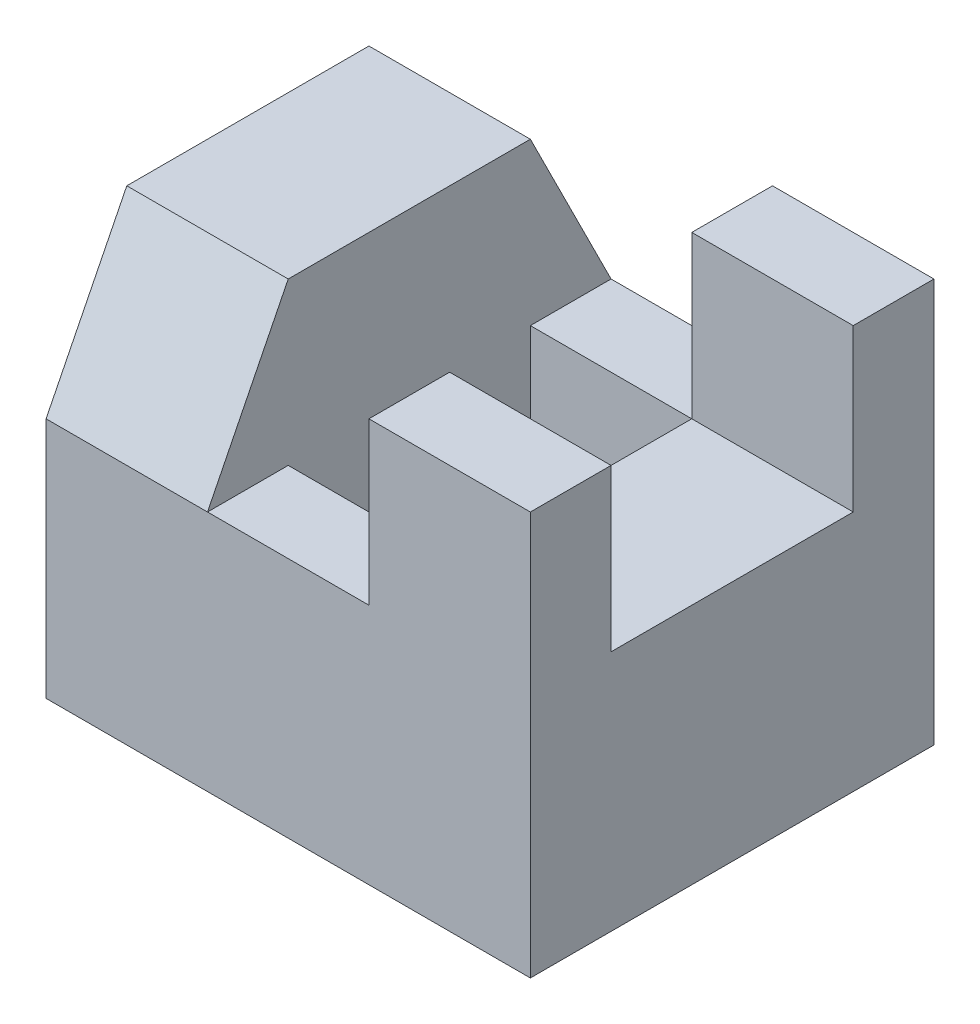
ISO-10303-21;
HEADER;
FILE_DESCRIPTION(('STEP AP214'),'2;1');
FILE_NAME('part.step','',(''),(''),'','','');
FILE_SCHEMA(('AUTOMOTIVE_DESIGN { 1 0 10303 214 1 1 1 1 }'));
ENDSEC;
DATA;
#1=APPLICATION_CONTEXT('core data for automotive mechanical design processes');
#2=APPLICATION_PROTOCOL_DEFINITION('international standard','automotive_design',2000,#1);
#3=PRODUCT_CONTEXT('',#1,'mechanical');
#4=PRODUCT('Part','Part','',(#3));
#5=PRODUCT_RELATED_PRODUCT_CATEGORY('part','',(#4));
#6=PRODUCT_DEFINITION_FORMATION('','',#4);
#7=PRODUCT_DEFINITION_CONTEXT('part definition',#1,'design');
#8=PRODUCT_DEFINITION('design','',#6,#7);
#9=PRODUCT_DEFINITION_SHAPE('','',#8);
#10=(LENGTH_UNIT() NAMED_UNIT(*) SI_UNIT(.MILLI.,.METRE.));
#11=(NAMED_UNIT(*) PLANE_ANGLE_UNIT() SI_UNIT($,.RADIAN.));
#12=(NAMED_UNIT(*) SI_UNIT($,.STERADIAN.) SOLID_ANGLE_UNIT());
#13=UNCERTAINTY_MEASURE_WITH_UNIT(LENGTH_MEASURE(1.E-05),#10,'distance_accuracy_value','');
#14=(GEOMETRIC_REPRESENTATION_CONTEXT(3) GLOBAL_UNCERTAINTY_ASSIGNED_CONTEXT((#13)) GLOBAL_UNIT_ASSIGNED_CONTEXT((#10,
#11,#12)) REPRESENTATION_CONTEXT('',''));
#15=CARTESIAN_POINT('',(0.,0.,0.));
#16=DIRECTION('',(0.,0.,1.));
#17=DIRECTION('',(1.,0.,0.));
#18=AXIS2_PLACEMENT_3D('',#15,#16,#17);
#19=CARTESIAN_POINT('',(0.,25.,25.));
#20=DIRECTION('',(0.,-1.,0.));
#21=DIRECTION('',(0.,0.,-1.));
#22=AXIS2_PLACEMENT_3D('',#19,#20,#21);
#23=PLANE('',#22);
#24=DIRECTION('',(0.,0.,-1.));
#25=VECTOR('',#24,1.);
#26=CARTESIAN_POINT('',(20.,25.,0.));
#27=LINE('',#26,#25);
#28=CARTESIAN_POINT('',(20.,25.,5.));
#29=VERTEX_POINT('',#28);
#30=CARTESIAN_POINT('',(20.,25.,0.));
#31=VERTEX_POINT('',#30);
#32=EDGE_CURVE('E205',#29,#31,#27,.T.);
#33=ORIENTED_EDGE('',*,*,#32,.F.);
#34=DIRECTION('',(-1.,0.,0.));
#35=VECTOR('',#34,1.);
#36=CARTESIAN_POINT('',(20.,25.,5.));
#37=LINE('',#36,#35);
#38=CARTESIAN_POINT('',(30.,25.,5.));
#39=VERTEX_POINT('',#38);
#40=EDGE_CURVE('E166',#39,#29,#37,.T.);
#41=ORIENTED_EDGE('',*,*,#40,.F.);
#42=DIRECTION('',(0.,0.,-1.));
#43=VECTOR('',#42,1.);
#44=CARTESIAN_POINT('',(30.,25.,25.));
#45=LINE('',#44,#43);
#46=CARTESIAN_POINT('',(30.,25.,0.));
#47=VERTEX_POINT('',#46);
#48=EDGE_CURVE('E254',#39,#47,#45,.T.);
#49=ORIENTED_EDGE('',*,*,#48,.T.);
#50=DIRECTION('',(-1.,0.,0.));
#51=VECTOR('',#50,1.);
#52=CARTESIAN_POINT('',(0.,25.,0.));
#53=LINE('',#52,#51);
#54=EDGE_CURVE('E236',#47,#31,#53,.T.);
#55=ORIENTED_EDGE('',*,*,#54,.T.);
#56=EDGE_LOOP('',(#33,#41,#49,#55));
#57=FACE_BOUND('',#56,.T.);
#58=ADVANCED_FACE('F33',(#57),#23,.F.);
#59=CARTESIAN_POINT('',(20.,15.,0.));
#60=DIRECTION('',(1.,0.,0.));
#61=DIRECTION('',(0.,0.,-1.));
#62=AXIS2_PLACEMENT_3D('',#59,#60,#61);
#63=PLANE('',#62);
#64=DIRECTION('',(0.,0.,-1.));
#65=VECTOR('',#64,1.);
#66=CARTESIAN_POINT('',(20.,15.,0.));
#67=LINE('',#66,#65);
#68=CARTESIAN_POINT('',(20.,15.,5.));
#69=VERTEX_POINT('',#68);
#70=CARTESIAN_POINT('',(20.,15.,0.));
#71=VERTEX_POINT('',#70);
#72=EDGE_CURVE('E195',#69,#71,#67,.T.);
#73=ORIENTED_EDGE('',*,*,#72,.F.);
#74=DIRECTION('',(0.,1.,0.));
#75=VECTOR('',#74,1.);
#76=CARTESIAN_POINT('',(20.,15.,5.));
#77=LINE('',#76,#75);
#78=EDGE_CURVE('E188',#69,#29,#77,.T.);
#79=ORIENTED_EDGE('',*,*,#78,.T.);
#80=ORIENTED_EDGE('',*,*,#32,.T.);
#81=DIRECTION('',(0.,1.,0.));
#82=VECTOR('',#81,1.);
#83=CARTESIAN_POINT('',(20.,15.,0.));
#84=LINE('',#83,#82);
#85=EDGE_CURVE('E209',#71,#31,#84,.T.);
#86=ORIENTED_EDGE('',*,*,#85,.F.);
#87=EDGE_LOOP('',(#73,#79,#80,#86));
#88=FACE_BOUND('',#87,.T.);
#89=ADVANCED_FACE('F329',(#88),#63,.F.);
#90=DIRECTION('',(0.,0.,1.));
#91=VECTOR('',#90,1.);
#92=CARTESIAN_POINT('',(20.,15.,5.));
#93=LINE('',#92,#91);
#94=CARTESIAN_POINT('',(20.,15.,20.));
#95=VERTEX_POINT('',#94);
#96=EDGE_CURVE('E156',#69,#95,#93,.T.);
#97=ORIENTED_EDGE('',*,*,#96,.F.);
#98=DIRECTION('',(0.,1.,0.));
#99=VECTOR('',#98,1.);
#100=CARTESIAN_POINT('',(20.,-15.,5.));
#101=LINE('',#100,#99);
#102=CARTESIAN_POINT('',(20.,0.,5.));
#103=VERTEX_POINT('',#102);
#104=EDGE_CURVE('E181',#103,#69,#101,.T.);
#105=ORIENTED_EDGE('',*,*,#104,.F.);
#106=DIRECTION('',(0.,0.,-1.));
#107=VECTOR('',#106,1.);
#108=CARTESIAN_POINT('',(20.,0.,25.));
#109=LINE('',#108,#107);
#110=CARTESIAN_POINT('',(20.,0.,20.));
#111=VERTEX_POINT('',#110);
#112=EDGE_CURVE('E179',#111,#103,#109,.T.);
#113=ORIENTED_EDGE('',*,*,#112,.F.);
#114=DIRECTION('',(0.,1.,0.));
#115=VECTOR('',#114,1.);
#116=CARTESIAN_POINT('',(20.,-15.,20.));
#117=LINE('',#116,#115);
#118=EDGE_CURVE('E48',#111,#95,#117,.T.);
#119=ORIENTED_EDGE('',*,*,#118,.T.);
#120=EDGE_LOOP('',(#97,#105,#113,#119));
#121=FACE_BOUND('',#120,.T.);
#122=ADVANCED_FACE('F177',(#121),#63,.F.);
#123=CARTESIAN_POINT('',(0.,15.,0.));
#124=DIRECTION('',(0.,1.,0.));
#125=DIRECTION('',(0.,0.,1.));
#126=AXIS2_PLACEMENT_3D('',#123,#124,#125);
#127=PLANE('',#126);
#128=DIRECTION('',(-1.,0.,0.));
#129=VECTOR('',#128,1.);
#130=CARTESIAN_POINT('',(10.,15.,5.));
#131=LINE('',#130,#129);
#132=CARTESIAN_POINT('',(10.,15.,5.));
#133=VERTEX_POINT('',#132);
#134=EDGE_CURVE('E187',#69,#133,#131,.T.);
#135=ORIENTED_EDGE('',*,*,#134,.F.);
#136=ORIENTED_EDGE('',*,*,#72,.T.);
#137=DIRECTION('',(-1.,0.,0.));
#138=VECTOR('',#137,1.);
#139=CARTESIAN_POINT('',(10.,15.,0.));
#140=LINE('',#139,#138);
#141=CARTESIAN_POINT('',(10.,15.,0.));
#142=VERTEX_POINT('',#141);
#143=EDGE_CURVE('E194',#71,#142,#140,.T.);
#144=ORIENTED_EDGE('',*,*,#143,.T.);
#145=DIRECTION('',(0.,0.,1.));
#146=VECTOR('',#145,1.);
#147=CARTESIAN_POINT('',(10.,15.,0.));
#148=LINE('',#147,#146);
#149=EDGE_CURVE('E299',#142,#133,#148,.T.);
#150=ORIENTED_EDGE('',*,*,#149,.T.);
#151=EDGE_LOOP('',(#135,#136,#144,#150));
#152=FACE_BOUND('',#151,.T.);
#153=ADVANCED_FACE('F326',(#152),#127,.T.);
#154=DIRECTION('',(-1.,0.,0.));
#155=VECTOR('',#154,1.);
#156=CARTESIAN_POINT('',(10.,25.,20.));
#157=LINE('',#156,#155);
#158=CARTESIAN_POINT('',(10.,25.,20.));
#159=VERTEX_POINT('',#158);
#160=CARTESIAN_POINT('',(0.,25.,20.));
#161=VERTEX_POINT('',#160);
#162=EDGE_CURVE('E228',#159,#161,#157,.T.);
#163=ORIENTED_EDGE('',*,*,#162,.F.);
#164=DIRECTION('',(0.,0.,1.));
#165=VECTOR('',#164,1.);
#166=CARTESIAN_POINT('',(10.,25.,0.));
#167=LINE('',#166,#165);
#168=CARTESIAN_POINT('',(10.,25.,5.));
#169=VERTEX_POINT('',#168);
#170=EDGE_CURVE('E203',#169,#159,#167,.T.);
#171=ORIENTED_EDGE('',*,*,#170,.F.);
#172=DIRECTION('',(-1.,0.,0.));
#173=VECTOR('',#172,1.);
#174=CARTESIAN_POINT('',(10.,25.,5.));
#175=LINE('',#174,#173);
#176=CARTESIAN_POINT('',(0.,25.,5.));
#177=VERTEX_POINT('',#176);
#178=EDGE_CURVE('E220',#169,#177,#175,.T.);
#179=ORIENTED_EDGE('',*,*,#178,.T.);
#180=DIRECTION('',(0.,0.,-1.));
#181=VECTOR('',#180,1.);
#182=CARTESIAN_POINT('',(0.,25.,25.));
#183=LINE('',#182,#181);
#184=EDGE_CURVE('E243',#161,#177,#183,.T.);
#185=ORIENTED_EDGE('',*,*,#184,.F.);
#186=EDGE_LOOP('',(#163,#171,#179,#185));
#187=FACE_BOUND('',#186,.T.);
#188=ADVANCED_FACE('F320',(#187),#23,.F.);
#189=CARTESIAN_POINT('',(0.,0.,25.));
#190=DIRECTION('',(1.,0.,0.));
#191=DIRECTION('',(0.,0.,-1.));
#192=AXIS2_PLACEMENT_3D('',#189,#190,#191);
#193=PLANE('',#192);
#194=ORIENTED_EDGE('',*,*,#184,.T.);
#195=DIRECTION('',(0.,0.894427190999916,0.447213595499958));
#196=VECTOR('',#195,1.);
#197=CARTESIAN_POINT('',(0.,15.,0.));
#198=LINE('',#197,#196);
#199=CARTESIAN_POINT('',(0.,15.,0.));
#200=VERTEX_POINT('',#199);
#201=EDGE_CURVE('E217',#200,#177,#198,.T.);
#202=ORIENTED_EDGE('',*,*,#201,.F.);
#203=DIRECTION('',(0.,-1.,0.));
#204=VECTOR('',#203,1.);
#205=CARTESIAN_POINT('',(0.,0.,0.));
#206=LINE('',#205,#204);
#207=CARTESIAN_POINT('',(0.,0.,0.));
#208=VERTEX_POINT('',#207);
#209=EDGE_CURVE('E223',#200,#208,#206,.T.);
#210=ORIENTED_EDGE('',*,*,#209,.T.);
#211=DIRECTION('',(0.,0.,-1.));
#212=VECTOR('',#211,1.);
#213=CARTESIAN_POINT('',(0.,0.,25.));
#214=LINE('',#213,#212);
#215=CARTESIAN_POINT('',(0.,0.,25.));
#216=VERTEX_POINT('',#215);
#217=EDGE_CURVE('E11',#216,#208,#214,.T.);
#218=ORIENTED_EDGE('',*,*,#217,.F.);
#219=DIRECTION('',(0.,-1.,0.));
#220=VECTOR('',#219,1.);
#221=CARTESIAN_POINT('',(0.,0.,25.));
#222=LINE('',#221,#220);
#223=CARTESIAN_POINT('',(0.,15.,25.));
#224=VERTEX_POINT('',#223);
#225=EDGE_CURVE('E233',#224,#216,#222,.T.);
#226=ORIENTED_EDGE('',*,*,#225,.F.);
#227=DIRECTION('',(0.,-0.894427190999916,0.447213595499958));
#228=VECTOR('',#227,1.);
#229=CARTESIAN_POINT('',(0.,25.,20.));
#230=LINE('',#229,#228);
#231=EDGE_CURVE('E212',#161,#224,#230,.T.);
#232=ORIENTED_EDGE('',*,*,#231,.F.);
#233=EDGE_LOOP('',(#194,#202,#210,#218,#226,#232));
#234=FACE_BOUND('',#233,.T.);
#235=ADVANCED_FACE('F35',(#234),#193,.F.);
#236=CARTESIAN_POINT('',(0.,0.,25.));
#237=DIRECTION('',(0.,1.,0.));
#238=DIRECTION('',(0.,0.,1.));
#239=AXIS2_PLACEMENT_3D('',#236,#237,#238);
#240=PLANE('',#239);
#241=DIRECTION('',(-1.,0.,0.));
#242=VECTOR('',#241,1.);
#243=CARTESIAN_POINT('',(0.,0.,5.));
#244=LINE('',#243,#242);
#245=CARTESIAN_POINT('',(10.,0.,5.));
#246=VERTEX_POINT('',#245);
#247=EDGE_CURVE('E295',#103,#246,#244,.T.);
#248=ORIENTED_EDGE('',*,*,#247,.T.);
#249=DIRECTION('',(0.,0.,1.));
#250=VECTOR('',#249,1.);
#251=CARTESIAN_POINT('',(10.,0.,25.));
#252=LINE('',#251,#250);
#253=CARTESIAN_POINT('',(10.,0.,20.));
#254=VERTEX_POINT('',#253);
#255=EDGE_CURVE('E206',#246,#254,#252,.T.);
#256=ORIENTED_EDGE('',*,*,#255,.T.);
#257=DIRECTION('',(1.,0.,0.));
#258=VECTOR('',#257,1.);
#259=CARTESIAN_POINT('',(0.,0.,20.));
#260=LINE('',#259,#258);
#261=EDGE_CURVE('E290',#254,#111,#260,.T.);
#262=ORIENTED_EDGE('',*,*,#261,.T.);
#263=ORIENTED_EDGE('',*,*,#112,.T.);
#264=EDGE_LOOP('',(#248,#256,#262,#263));
#265=FACE_BOUND('',#264,.T.);
#266=DIRECTION('',(1.,0.,0.));
#267=VECTOR('',#266,1.);
#268=CARTESIAN_POINT('',(0.,0.,0.));
#269=LINE('',#268,#267);
#270=CARTESIAN_POINT('',(30.,0.,0.));
#271=VERTEX_POINT('',#270);
#272=EDGE_CURVE('E245',#208,#271,#269,.T.);
#273=ORIENTED_EDGE('',*,*,#272,.T.);
#274=DIRECTION('',(0.,0.,-1.));
#275=VECTOR('',#274,1.);
#276=CARTESIAN_POINT('',(30.,0.,25.));
#277=LINE('',#276,#275);
#278=CARTESIAN_POINT('',(30.,0.,25.));
#279=VERTEX_POINT('',#278);
#280=EDGE_CURVE('E41',#279,#271,#277,.T.);
#281=ORIENTED_EDGE('',*,*,#280,.F.);
#282=DIRECTION('',(1.,0.,0.));
#283=VECTOR('',#282,1.);
#284=CARTESIAN_POINT('',(0.,0.,25.));
#285=LINE('',#284,#283);
#286=EDGE_CURVE('E235',#216,#279,#285,.T.);
#287=ORIENTED_EDGE('',*,*,#286,.F.);
#288=ORIENTED_EDGE('',*,*,#217,.T.);
#289=EDGE_LOOP('',(#273,#281,#287,#288));
#290=FACE_BOUND('',#289,.T.);
#291=ADVANCED_FACE('F338',(#265,#290),#240,.F.);
#292=CARTESIAN_POINT('',(30.,0.,25.));
#293=DIRECTION('',(-1.,0.,0.));
#294=DIRECTION('',(0.,0.,1.));
#295=AXIS2_PLACEMENT_3D('',#292,#293,#294);
#296=PLANE('',#295);
#297=ORIENTED_EDGE('',*,*,#48,.F.);
#298=DIRECTION('',(0.,1.,0.));
#299=VECTOR('',#298,1.);
#300=CARTESIAN_POINT('',(30.,15.,5.));
#301=LINE('',#300,#299);
#302=CARTESIAN_POINT('',(30.,15.,5.));
#303=VERTEX_POINT('',#302);
#304=EDGE_CURVE('E278',#303,#39,#301,.T.);
#305=ORIENTED_EDGE('',*,*,#304,.F.);
#306=DIRECTION('',(0.,0.,-1.));
#307=VECTOR('',#306,1.);
#308=CARTESIAN_POINT('',(30.,15.,5.));
#309=LINE('',#308,#307);
#310=CARTESIAN_POINT('',(30.,15.,20.));
#311=VERTEX_POINT('',#310);
#312=EDGE_CURVE('E155',#311,#303,#309,.T.);
#313=ORIENTED_EDGE('',*,*,#312,.F.);
#314=DIRECTION('',(0.,1.,0.));
#315=VECTOR('',#314,1.);
#316=CARTESIAN_POINT('',(30.,15.,20.));
#317=LINE('',#316,#315);
#318=CARTESIAN_POINT('',(30.,25.,20.));
#319=VERTEX_POINT('',#318);
#320=EDGE_CURVE('E152',#311,#319,#317,.T.);
#321=ORIENTED_EDGE('',*,*,#320,.T.);
#322=CARTESIAN_POINT('',(30.,25.,25.));
#323=VERTEX_POINT('',#322);
#324=EDGE_CURVE('E255',#323,#319,#45,.T.);
#325=ORIENTED_EDGE('',*,*,#324,.F.);
#326=DIRECTION('',(0.,1.,0.));
#327=VECTOR('',#326,1.);
#328=CARTESIAN_POINT('',(30.,0.,25.));
#329=LINE('',#328,#327);
#330=EDGE_CURVE('E238',#279,#323,#329,.T.);
#331=ORIENTED_EDGE('',*,*,#330,.F.);
#332=ORIENTED_EDGE('',*,*,#280,.T.);
#333=DIRECTION('',(0.,1.,0.));
#334=VECTOR('',#333,1.);
#335=CARTESIAN_POINT('',(30.,0.,0.));
#336=LINE('',#335,#334);
#337=EDGE_CURVE('E247',#271,#47,#336,.T.);
#338=ORIENTED_EDGE('',*,*,#337,.T.);
#339=EDGE_LOOP('',(#297,#305,#313,#321,#325,#331,#332,#338));
#340=FACE_BOUND('',#339,.T.);
#341=ADVANCED_FACE('F263',(#340),#296,.F.);
#342=ORIENTED_EDGE('',*,*,#324,.T.);
#343=DIRECTION('',(1.,0.,0.));
#344=VECTOR('',#343,1.);
#345=CARTESIAN_POINT('',(20.,25.,20.));
#346=LINE('',#345,#344);
#347=CARTESIAN_POINT('',(20.,25.,20.));
#348=VERTEX_POINT('',#347);
#349=EDGE_CURVE('E331',#348,#319,#346,.T.);
#350=ORIENTED_EDGE('',*,*,#349,.F.);
#351=CARTESIAN_POINT('',(20.,25.,25.));
#352=VERTEX_POINT('',#351);
#353=EDGE_CURVE('E175',#352,#348,#27,.T.);
#354=ORIENTED_EDGE('',*,*,#353,.F.);
#355=DIRECTION('',(-1.,0.,0.));
#356=VECTOR('',#355,1.);
#357=CARTESIAN_POINT('',(0.,25.,25.));
#358=LINE('',#357,#356);
#359=EDGE_CURVE('E240',#323,#352,#358,.T.);
#360=ORIENTED_EDGE('',*,*,#359,.F.);
#361=EDGE_LOOP('',(#342,#350,#354,#360));
#362=FACE_BOUND('',#361,.T.);
#363=ADVANCED_FACE('F337',(#362),#23,.F.);
#364=CARTESIAN_POINT('',(0.,0.,25.));
#365=DIRECTION('',(0.,0.,-1.));
#366=DIRECTION('',(-1.,0.,0.));
#367=AXIS2_PLACEMENT_3D('',#364,#365,#366);
#368=PLANE('',#367);
#369=ORIENTED_EDGE('',*,*,#359,.T.);
#370=DIRECTION('',(0.,1.,0.));
#371=VECTOR('',#370,1.);
#372=CARTESIAN_POINT('',(20.,15.,25.));
#373=LINE('',#372,#371);
#374=CARTESIAN_POINT('',(20.,15.,25.));
#375=VERTEX_POINT('',#374);
#376=EDGE_CURVE('E198',#375,#352,#373,.T.);
#377=ORIENTED_EDGE('',*,*,#376,.F.);
#378=DIRECTION('',(1.,0.,0.));
#379=VECTOR('',#378,1.);
#380=CARTESIAN_POINT('',(10.,15.,25.));
#381=LINE('',#380,#379);
#382=CARTESIAN_POINT('',(10.,15.,25.));
#383=VERTEX_POINT('',#382);
#384=EDGE_CURVE('E192',#383,#375,#381,.T.);
#385=ORIENTED_EDGE('',*,*,#384,.F.);
#386=DIRECTION('',(-1.,0.,0.));
#387=VECTOR('',#386,1.);
#388=CARTESIAN_POINT('',(10.,15.,25.));
#389=LINE('',#388,#387);
#390=EDGE_CURVE('E219',#383,#224,#389,.T.);
#391=ORIENTED_EDGE('',*,*,#390,.T.);
#392=ORIENTED_EDGE('',*,*,#225,.T.);
#393=ORIENTED_EDGE('',*,*,#286,.T.);
#394=ORIENTED_EDGE('',*,*,#330,.T.);
#395=EDGE_LOOP('',(#369,#377,#385,#391,#392,#393,#394));
#396=FACE_BOUND('',#395,.T.);
#397=ADVANCED_FACE('F311',(#396),#368,.F.);
#398=CARTESIAN_POINT('',(0.,0.,0.));
#399=DIRECTION('',(0.,0.,-1.));
#400=DIRECTION('',(-1.,0.,0.));
#401=AXIS2_PLACEMENT_3D('',#398,#399,#400);
#402=PLANE('',#401);
#403=ORIENTED_EDGE('',*,*,#85,.T.);
#404=ORIENTED_EDGE('',*,*,#54,.F.);
#405=ORIENTED_EDGE('',*,*,#337,.F.);
#406=ORIENTED_EDGE('',*,*,#272,.F.);
#407=ORIENTED_EDGE('',*,*,#209,.F.);
#408=DIRECTION('',(-1.,0.,0.));
#409=VECTOR('',#408,1.);
#410=CARTESIAN_POINT('',(10.,15.,0.));
#411=LINE('',#410,#409);
#412=EDGE_CURVE('E216',#142,#200,#411,.T.);
#413=ORIENTED_EDGE('',*,*,#412,.F.);
#414=ORIENTED_EDGE('',*,*,#143,.F.);
#415=EDGE_LOOP('',(#403,#404,#405,#406,#407,#413,#414));
#416=FACE_BOUND('',#415,.T.);
#417=ADVANCED_FACE('F270',(#416),#402,.T.);
#418=CARTESIAN_POINT('',(10.,15.,0.));
#419=DIRECTION('',(0.,-0.447213595499958,0.894427190999916));
#420=DIRECTION('',(0.,-0.894427190999916,-0.447213595499958));
#421=AXIS2_PLACEMENT_3D('',#418,#419,#420);
#422=PLANE('',#421);
#423=ORIENTED_EDGE('',*,*,#201,.T.);
#424=ORIENTED_EDGE('',*,*,#178,.F.);
#425=DIRECTION('',(0.,0.894427190999916,0.447213595499958));
#426=VECTOR('',#425,1.);
#427=CARTESIAN_POINT('',(10.,15.,0.));
#428=LINE('',#427,#426);
#429=EDGE_CURVE('E214',#142,#169,#428,.T.);
#430=ORIENTED_EDGE('',*,*,#429,.F.);
#431=ORIENTED_EDGE('',*,*,#412,.T.);
#432=EDGE_LOOP('',(#423,#424,#430,#431));
#433=FACE_BOUND('',#432,.T.);
#434=ADVANCED_FACE('F324',(#433),#422,.F.);
#435=CARTESIAN_POINT('',(10.,25.,20.));
#436=DIRECTION('',(0.,-0.447213595499958,-0.894427190999916));
#437=DIRECTION('',(0.,0.894427190999916,-0.447213595499958));
#438=AXIS2_PLACEMENT_3D('',#435,#436,#437);
#439=PLANE('',#438);
#440=ORIENTED_EDGE('',*,*,#231,.T.);
#441=ORIENTED_EDGE('',*,*,#390,.F.);
#442=DIRECTION('',(0.,-0.894427190999916,0.447213595499958));
#443=VECTOR('',#442,1.);
#444=CARTESIAN_POINT('',(10.,25.,20.));
#445=LINE('',#444,#443);
#446=EDGE_CURVE('E225',#159,#383,#445,.T.);
#447=ORIENTED_EDGE('',*,*,#446,.F.);
#448=ORIENTED_EDGE('',*,*,#162,.T.);
#449=EDGE_LOOP('',(#440,#441,#447,#448));
#450=FACE_BOUND('',#449,.T.);
#451=ADVANCED_FACE('F313',(#450),#439,.F.);
#452=CARTESIAN_POINT('',(10.,15.,0.));
#453=DIRECTION('',(-1.,0.,0.));
#454=DIRECTION('',(0.,0.,1.));
#455=AXIS2_PLACEMENT_3D('',#452,#453,#454);
#456=PLANE('',#455);
#457=ORIENTED_EDGE('',*,*,#170,.T.);
#458=ORIENTED_EDGE('',*,*,#446,.T.);
#459=CARTESIAN_POINT('',(10.,15.,20.));
#460=VERTEX_POINT('',#459);
#461=EDGE_CURVE('E208',#460,#383,#148,.T.);
#462=ORIENTED_EDGE('',*,*,#461,.F.);
#463=DIRECTION('',(0.,1.,0.));
#464=VECTOR('',#463,1.);
#465=CARTESIAN_POINT('',(10.,-15.,20.));
#466=LINE('',#465,#464);
#467=EDGE_CURVE('E53',#254,#460,#466,.T.);
#468=ORIENTED_EDGE('',*,*,#467,.F.);
#469=ORIENTED_EDGE('',*,*,#255,.F.);
#470=DIRECTION('',(0.,1.,0.));
#471=VECTOR('',#470,1.);
#472=CARTESIAN_POINT('',(10.,-15.,5.));
#473=LINE('',#472,#471);
#474=EDGE_CURVE('E288',#246,#133,#473,.T.);
#475=ORIENTED_EDGE('',*,*,#474,.T.);
#476=ORIENTED_EDGE('',*,*,#149,.F.);
#477=ORIENTED_EDGE('',*,*,#429,.T.);
#478=EDGE_LOOP('',(#457,#458,#462,#468,#469,#475,#476,#477));
#479=FACE_BOUND('',#478,.T.);
#480=ADVANCED_FACE('F305',(#479),#456,.F.);
#481=ORIENTED_EDGE('',*,*,#353,.T.);
#482=DIRECTION('',(0.,1.,0.));
#483=VECTOR('',#482,1.);
#484=CARTESIAN_POINT('',(20.,15.,20.));
#485=LINE('',#484,#483);
#486=EDGE_CURVE('E149',#95,#348,#485,.T.);
#487=ORIENTED_EDGE('',*,*,#486,.F.);
#488=EDGE_CURVE('E172',#375,#95,#67,.T.);
#489=ORIENTED_EDGE('',*,*,#488,.F.);
#490=ORIENTED_EDGE('',*,*,#376,.T.);
#491=EDGE_LOOP('',(#481,#487,#489,#490));
#492=FACE_BOUND('',#491,.T.);
#493=ADVANCED_FACE('F170',(#492),#63,.F.);
#494=DIRECTION('',(1.,0.,0.));
#495=VECTOR('',#494,1.);
#496=CARTESIAN_POINT('',(10.,15.,20.));
#497=LINE('',#496,#495);
#498=EDGE_CURVE('E183',#460,#95,#497,.T.);
#499=ORIENTED_EDGE('',*,*,#498,.F.);
#500=ORIENTED_EDGE('',*,*,#461,.T.);
#501=ORIENTED_EDGE('',*,*,#384,.T.);
#502=ORIENTED_EDGE('',*,*,#488,.T.);
#503=EDGE_LOOP('',(#499,#500,#501,#502));
#504=FACE_BOUND('',#503,.T.);
#505=ADVANCED_FACE('F190',(#504),#127,.T.);
#506=CARTESIAN_POINT('',(10.,-15.,5.));
#507=DIRECTION('',(0.,0.,-1.));
#508=DIRECTION('',(-1.,0.,0.));
#509=AXIS2_PLACEMENT_3D('',#506,#507,#508);
#510=PLANE('',#509);
#511=ORIENTED_EDGE('',*,*,#104,.T.);
#512=ORIENTED_EDGE('',*,*,#134,.T.);
#513=ORIENTED_EDGE('',*,*,#474,.F.);
#514=ORIENTED_EDGE('',*,*,#247,.F.);
#515=EDGE_LOOP('',(#511,#512,#513,#514));
#516=FACE_BOUND('',#515,.T.);
#517=ADVANCED_FACE('F372',(#516),#510,.F.);
#518=CARTESIAN_POINT('',(10.,-15.,20.));
#519=DIRECTION('',(0.,0.,1.));
#520=DIRECTION('',(1.,0.,0.));
#521=AXIS2_PLACEMENT_3D('',#518,#519,#520);
#522=PLANE('',#521);
#523=ORIENTED_EDGE('',*,*,#467,.T.);
#524=ORIENTED_EDGE('',*,*,#498,.T.);
#525=ORIENTED_EDGE('',*,*,#118,.F.);
#526=ORIENTED_EDGE('',*,*,#261,.F.);
#527=EDGE_LOOP('',(#523,#524,#525,#526));
#528=FACE_BOUND('',#527,.T.);
#529=ADVANCED_FACE('F184',(#528),#522,.F.);
#530=CARTESIAN_POINT('',(20.,15.,5.));
#531=DIRECTION('',(0.,0.,-1.));
#532=DIRECTION('',(-1.,0.,0.));
#533=AXIS2_PLACEMENT_3D('',#530,#531,#532);
#534=PLANE('',#533);
#535=ORIENTED_EDGE('',*,*,#40,.T.);
#536=ORIENTED_EDGE('',*,*,#78,.F.);
#537=DIRECTION('',(-1.,0.,0.));
#538=VECTOR('',#537,1.);
#539=CARTESIAN_POINT('',(20.,15.,5.));
#540=LINE('',#539,#538);
#541=EDGE_CURVE('E161',#303,#69,#540,.T.);
#542=ORIENTED_EDGE('',*,*,#541,.F.);
#543=ORIENTED_EDGE('',*,*,#304,.T.);
#544=EDGE_LOOP('',(#535,#536,#542,#543));
#545=FACE_BOUND('',#544,.T.);
#546=ADVANCED_FACE('F330',(#545),#534,.F.);
#547=CARTESIAN_POINT('',(20.,15.,20.));
#548=DIRECTION('',(0.,0.,1.));
#549=DIRECTION('',(1.,0.,0.));
#550=AXIS2_PLACEMENT_3D('',#547,#548,#549);
#551=PLANE('',#550);
#552=ORIENTED_EDGE('',*,*,#349,.T.);
#553=ORIENTED_EDGE('',*,*,#320,.F.);
#554=DIRECTION('',(1.,0.,0.));
#555=VECTOR('',#554,1.);
#556=CARTESIAN_POINT('',(20.,15.,20.));
#557=LINE('',#556,#555);
#558=EDGE_CURVE('E145',#95,#311,#557,.T.);
#559=ORIENTED_EDGE('',*,*,#558,.F.);
#560=ORIENTED_EDGE('',*,*,#486,.T.);
#561=EDGE_LOOP('',(#552,#553,#559,#560));
#562=FACE_BOUND('',#561,.T.);
#563=ADVANCED_FACE('F147',(#562),#551,.F.);
#564=CARTESIAN_POINT('',(0.,15.,0.));
#565=DIRECTION('',(0.,1.,0.));
#566=DIRECTION('',(0.,0.,1.));
#567=AXIS2_PLACEMENT_3D('',#564,#565,#566);
#568=PLANE('',#567);
#569=ORIENTED_EDGE('',*,*,#96,.T.);
#570=ORIENTED_EDGE('',*,*,#558,.T.);
#571=ORIENTED_EDGE('',*,*,#312,.T.);
#572=ORIENTED_EDGE('',*,*,#541,.T.);
#573=EDGE_LOOP('',(#569,#570,#571,#572));
#574=FACE_BOUND('',#573,.T.);
#575=ADVANCED_FACE('F159',(#574),#568,.T.);
#576=CLOSED_SHELL('',(#58,#89,#122,#153,#188,#235,#291,#341,#363,#397,#417,#434,#451,#480,#493,
#505,#517,#529,#546,#563,#575));
#577=MANIFOLD_SOLID_BREP('B2',#576);
#578=ADVANCED_BREP_SHAPE_REPRESENTATION('',(#18,#577),#14);
#579=SHAPE_DEFINITION_REPRESENTATION(#9,#578);
ENDSEC;
END-ISO-10303-21;
